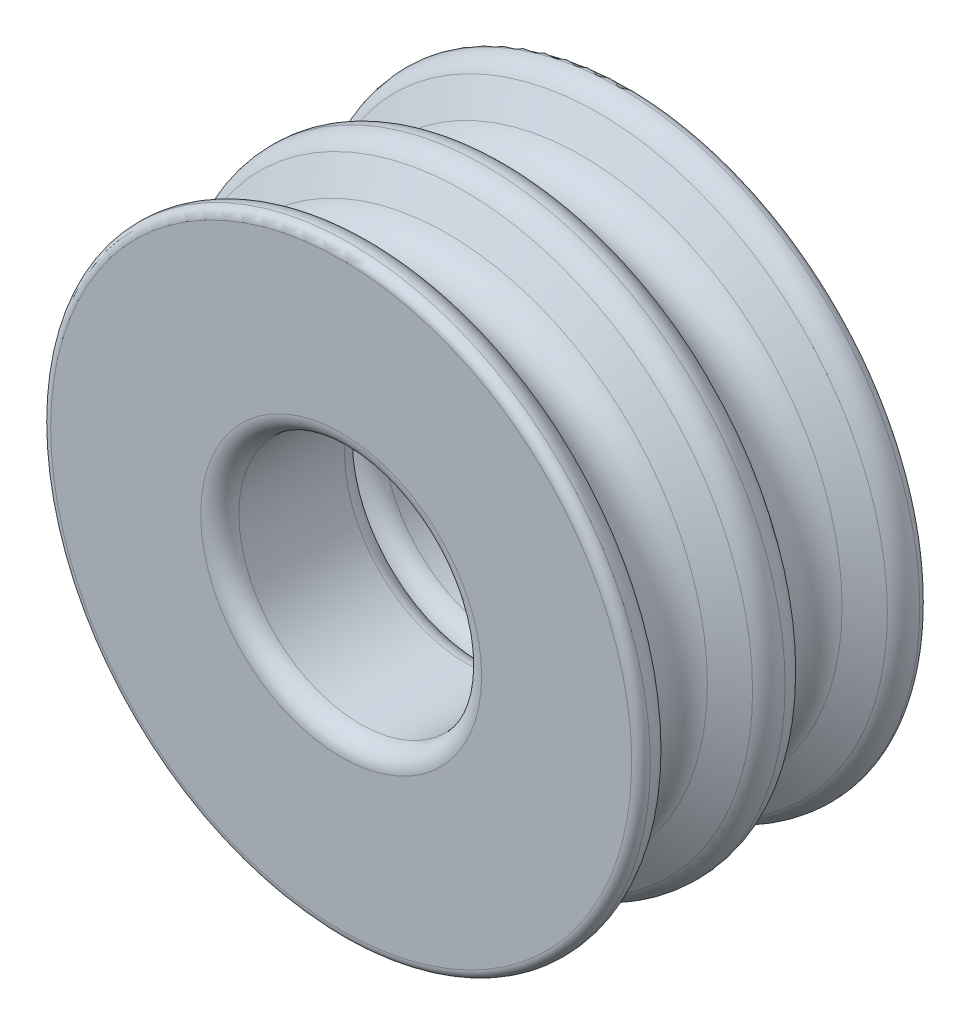
ISO-10303-21;
HEADER;
FILE_DESCRIPTION(('STEP AP214'),'2;1');
FILE_NAME('part.step','',(''),(''),'','','');
FILE_SCHEMA(('AUTOMOTIVE_DESIGN { 1 0 10303 214 1 1 1 1 }'));
ENDSEC;
DATA;
#1=APPLICATION_CONTEXT('core data for automotive mechanical design processes');
#2=APPLICATION_PROTOCOL_DEFINITION('international standard','automotive_design',2000,#1);
#3=PRODUCT_CONTEXT('',#1,'mechanical');
#4=PRODUCT('Part','Part','',(#3));
#5=PRODUCT_RELATED_PRODUCT_CATEGORY('part','',(#4));
#6=PRODUCT_DEFINITION_FORMATION('','',#4);
#7=PRODUCT_DEFINITION_CONTEXT('part definition',#1,'design');
#8=PRODUCT_DEFINITION('design','',#6,#7);
#9=PRODUCT_DEFINITION_SHAPE('','',#8);
#10=(LENGTH_UNIT() NAMED_UNIT(*) SI_UNIT(.MILLI.,.METRE.));
#11=(NAMED_UNIT(*) PLANE_ANGLE_UNIT() SI_UNIT($,.RADIAN.));
#12=(NAMED_UNIT(*) SI_UNIT($,.STERADIAN.) SOLID_ANGLE_UNIT());
#13=UNCERTAINTY_MEASURE_WITH_UNIT(LENGTH_MEASURE(1.E-05),#10,'distance_accuracy_value','');
#14=(GEOMETRIC_REPRESENTATION_CONTEXT(3) GLOBAL_UNCERTAINTY_ASSIGNED_CONTEXT((#13)) GLOBAL_UNIT_ASSIGNED_CONTEXT((#10,
#11,#12)) REPRESENTATION_CONTEXT('',''));
#15=CARTESIAN_POINT('',(0.,0.,0.));
#16=DIRECTION('',(0.,0.,1.));
#17=DIRECTION('',(1.,0.,0.));
#18=AXIS2_PLACEMENT_3D('',#15,#16,#17);
#19=CARTESIAN_POINT('',(0.,0.,3.5));
#20=DIRECTION('',(0.,0.,-1.));
#21=DIRECTION('',(-1.,0.,0.));
#22=AXIS2_PLACEMENT_3D('',#19,#20,#21);
#23=TOROIDAL_SURFACE('',#22,15.2006264756117,0.499999999999999);
#24=CARTESIAN_POINT('',(0.,0.,4.));
#25=DIRECTION('',(0.,0.,-1.));
#26=DIRECTION('',(-1.,0.,0.));
#27=AXIS2_PLACEMENT_3D('',#24,#25,#26);
#28=CIRCLE('',#27,15.2006264756117);
#29=CARTESIAN_POINT('',(-15.2006264756117,0.,4.));
#30=VERTEX_POINT('',#29);
#31=EDGE_CURVE('E69',#30,#30,#28,.T.);
#32=ORIENTED_EDGE('',*,*,#31,.T.);
#33=EDGE_LOOP('',(#32));
#34=FACE_BOUND('',#33,.T.);
#35=CARTESIAN_POINT('',(0.,0.,3.52502165342211));
#36=DIRECTION('',(0.,0.,-1.));
#37=DIRECTION('',(-1.,0.,0.));
#38=AXIS2_PLACEMENT_3D('',#35,#36,#37);
#39=CIRCLE('',#38,15.7);
#40=CARTESIAN_POINT('',(-15.7,0.,3.52502165342211));
#41=VERTEX_POINT('',#40);
#42=EDGE_CURVE('E51',#41,#41,#39,.T.);
#43=ORIENTED_EDGE('',*,*,#42,.F.);
#44=EDGE_LOOP('',(#43));
#45=FACE_BOUND('',#44,.T.);
#46=ADVANCED_FACE('F31',(#34,#45),#23,.T.);
#47=CARTESIAN_POINT('',(0.,0.,3.46496968520905));
#48=DIRECTION('',(0.,0.,-1.));
#49=DIRECTION('',(-1.,0.,0.));
#50=AXIS2_PLACEMENT_3D('',#47,#48,#49);
#51=TOROIDAL_SURFACE('',#50,14.501503541468,1.20000000000002);
#52=ORIENTED_EDGE('',*,*,#42,.T.);
#53=EDGE_LOOP('',(#52));
#54=FACE_BOUND('',#53,.T.);
#55=CARTESIAN_POINT('',(0.,0.,2.4257392006675));
#56=DIRECTION('',(0.,0.,-1.));
#57=DIRECTION('',(-1.,0.,0.));
#58=AXIS2_PLACEMENT_3D('',#55,#56,#57);
#59=CIRCLE('',#58,15.1015035414677);
#60=CARTESIAN_POINT('',(-15.1015035414677,0.,2.4257392006675));
#61=VERTEX_POINT('',#60);
#62=EDGE_CURVE('E54',#61,#61,#59,.T.);
#63=ORIENTED_EDGE('',*,*,#62,.F.);
#64=EDGE_LOOP('',(#63));
#65=FACE_BOUND('',#64,.T.);
#66=ADVANCED_FACE('F154',(#54,#65),#51,.T.);
#67=CARTESIAN_POINT('',(0.,0.,1.55884572681201));
#68=DIRECTION('',(0.,0.,1.));
#69=DIRECTION('',(1.,0.,0.));
#70=AXIS2_PLACEMENT_3D('',#67,#68,#69);
#71=CONICAL_SURFACE('',#70,13.6000000000001,1.04719755119661);
#72=ORIENTED_EDGE('',*,*,#62,.T.);
#73=EDGE_LOOP('',(#72));
#74=FACE_BOUND('',#73,.T.);
#75=CARTESIAN_POINT('',(0.,0.,1.55884572681201));
#76=DIRECTION('',(0.,0.,-1.));
#77=DIRECTION('',(-1.,0.,0.));
#78=AXIS2_PLACEMENT_3D('',#75,#76,#77);
#79=CIRCLE('',#78,13.6000000000001);
#80=CARTESIAN_POINT('',(-13.6000000000001,0.,1.55884572681201));
#81=VERTEX_POINT('',#80);
#82=EDGE_CURVE('E57',#81,#81,#79,.T.);
#83=ORIENTED_EDGE('',*,*,#82,.F.);
#84=EDGE_LOOP('',(#83));
#85=FACE_BOUND('',#84,.T.);
#86=ADVANCED_FACE('F160',(#74,#85),#71,.T.);
#87=CARTESIAN_POINT('',(0.,0.,0.));
#88=DIRECTION('',(0.,0.,-1.));
#89=DIRECTION('',(-1.,0.,0.));
#90=AXIS2_PLACEMENT_3D('',#87,#88,#89);
#91=TOROIDAL_SURFACE('',#90,14.5,1.79999999999998);
#92=ORIENTED_EDGE('',*,*,#82,.T.);
#93=EDGE_LOOP('',(#92));
#94=FACE_BOUND('',#93,.T.);
#95=CARTESIAN_POINT('',(0.,0.,-1.55884572681199));
#96=DIRECTION('',(0.,0.,-1.));
#97=DIRECTION('',(-1.,0.,0.));
#98=AXIS2_PLACEMENT_3D('',#95,#96,#97);
#99=CIRCLE('',#98,13.6);
#100=CARTESIAN_POINT('',(-13.6,0.,-1.55884572681199));
#101=VERTEX_POINT('',#100);
#102=EDGE_CURVE('E60',#101,#101,#99,.T.);
#103=ORIENTED_EDGE('',*,*,#102,.F.);
#104=EDGE_LOOP('',(#103));
#105=FACE_BOUND('',#104,.T.);
#106=ADVANCED_FACE('F150',(#94,#105),#91,.F.);
#107=CARTESIAN_POINT('',(0.,0.,-2.42573920066772));
#108=DIRECTION('',(0.,0.,-1.));
#109=DIRECTION('',(-1.,0.,0.));
#110=AXIS2_PLACEMENT_3D('',#107,#108,#109);
#111=CONICAL_SURFACE('',#110,15.101503541468,1.0471975511966);
#112=ORIENTED_EDGE('',*,*,#102,.T.);
#113=EDGE_LOOP('',(#112));
#114=FACE_BOUND('',#113,.T.);
#115=CARTESIAN_POINT('',(0.,0.,-2.42573920066772));
#116=DIRECTION('',(0.,0.,-1.));
#117=DIRECTION('',(-1.,0.,0.));
#118=AXIS2_PLACEMENT_3D('',#115,#116,#117);
#119=CIRCLE('',#118,15.101503541468);
#120=CARTESIAN_POINT('',(-15.101503541468,0.,-2.42573920066772));
#121=VERTEX_POINT('',#120);
#122=EDGE_CURVE('E63',#121,#121,#119,.T.);
#123=ORIENTED_EDGE('',*,*,#122,.F.);
#124=EDGE_LOOP('',(#123));
#125=FACE_BOUND('',#124,.T.);
#126=ADVANCED_FACE('F141',(#114,#125),#111,.T.);
#127=CARTESIAN_POINT('',(0.,0.,-3.46496968520905));
#128=DIRECTION('',(0.,0.,-1.));
#129=DIRECTION('',(-1.,0.,0.));
#130=AXIS2_PLACEMENT_3D('',#127,#128,#129);
#131=TOROIDAL_SURFACE('',#130,14.501503541468,1.2);
#132=ORIENTED_EDGE('',*,*,#122,.T.);
#133=EDGE_LOOP('',(#132));
#134=FACE_BOUND('',#133,.T.);
#135=CARTESIAN_POINT('',(0.,0.,-3.52502165342211));
#136=DIRECTION('',(0.,0.,-1.));
#137=DIRECTION('',(-1.,0.,0.));
#138=AXIS2_PLACEMENT_3D('',#135,#136,#137);
#139=CIRCLE('',#138,15.7);
#140=CARTESIAN_POINT('',(-15.7,0.,-3.52502165342211));
#141=VERTEX_POINT('',#140);
#142=EDGE_CURVE('E66',#141,#141,#139,.T.);
#143=ORIENTED_EDGE('',*,*,#142,.F.);
#144=EDGE_LOOP('',(#143));
#145=FACE_BOUND('',#144,.T.);
#146=ADVANCED_FACE('F138',(#134,#145),#131,.T.);
#147=CARTESIAN_POINT('',(0.,0.,3.99999999999767));
#148=DIRECTION('',(0.,0.,1.));
#149=DIRECTION('',(1.,0.,0.));
#150=AXIS2_PLACEMENT_3D('',#147,#148,#149);
#151=PLANE('',#150);
#152=CARTESIAN_POINT('',(0.,0.,3.99999999999767));
#153=DIRECTION('',(0.,0.,1.));
#154=DIRECTION('',(1.,0.,0.));
#155=AXIS2_PLACEMENT_3D('',#152,#153,#154);
#156=CIRCLE('',#155,7.35);
#157=CARTESIAN_POINT('',(7.35,0.,3.99999999999767));
#158=VERTEX_POINT('',#157);
#159=EDGE_CURVE('E10',#158,#158,#156,.F.);
#160=ORIENTED_EDGE('',*,*,#159,.T.);
#161=EDGE_LOOP('',(#160));
#162=FACE_BOUND('',#161,.T.);
#163=ORIENTED_EDGE('',*,*,#31,.F.);
#164=EDGE_LOOP('',(#163));
#165=FACE_BOUND('',#164,.T.);
#166=ADVANCED_FACE('F140',(#162,#165),#151,.T.);
#167=CARTESIAN_POINT('',(0.,0.,-3.52502165342211));
#168=DIRECTION('',(0.,0.,1.));
#169=DIRECTION('',(1.,0.,0.));
#170=AXIS2_PLACEMENT_3D('',#167,#168,#169);
#171=CYLINDRICAL_SURFACE('',#170,6.35);
#172=CARTESIAN_POINT('',(0.,0.,-2.52502165342211));
#173=DIRECTION('',(0.,0.,-1.));
#174=DIRECTION('',(-1.,0.,0.));
#175=AXIS2_PLACEMENT_3D('',#172,#173,#174);
#176=CIRCLE('',#175,6.35);
#177=CARTESIAN_POINT('',(-6.35,0.,-2.52502165342211));
#178=VERTEX_POINT('',#177);
#179=EDGE_CURVE('E38',#178,#178,#176,.T.);
#180=ORIENTED_EDGE('',*,*,#179,.T.);
#181=EDGE_LOOP('',(#180));
#182=FACE_BOUND('',#181,.T.);
#183=CARTESIAN_POINT('',(0.,0.,2.99999999999767));
#184=DIRECTION('',(0.,0.,1.));
#185=DIRECTION('',(1.,0.,0.));
#186=AXIS2_PLACEMENT_3D('',#183,#184,#185);
#187=CIRCLE('',#186,6.35);
#188=CARTESIAN_POINT('',(6.35,0.,2.99999999999767));
#189=VERTEX_POINT('',#188);
#190=EDGE_CURVE('E42',#189,#189,#187,.T.);
#191=ORIENTED_EDGE('',*,*,#190,.T.);
#192=EDGE_LOOP('',(#191));
#193=FACE_BOUND('',#192,.T.);
#194=ADVANCED_FACE('F148',(#182,#193),#171,.F.);
#195=CARTESIAN_POINT('',(0.,0.,-2.52502165342211));
#196=DIRECTION('',(0.,0.,-1.));
#197=DIRECTION('',(-1.,0.,0.));
#198=AXIS2_PLACEMENT_3D('',#195,#196,#197);
#199=TOROIDAL_SURFACE('',#198,7.35,1.);
#200=ORIENTED_EDGE('',*,*,#179,.F.);
#201=EDGE_LOOP('',(#200));
#202=FACE_BOUND('',#201,.T.);
#203=CARTESIAN_POINT('',(0.,0.,-3.52502165342211));
#204=DIRECTION('',(0.,0.,-1.));
#205=DIRECTION('',(-1.,0.,0.));
#206=AXIS2_PLACEMENT_3D('',#203,#204,#205);
#207=CIRCLE('',#206,7.35);
#208=CARTESIAN_POINT('',(-7.35,0.,-3.52502165342211));
#209=VERTEX_POINT('',#208);
#210=EDGE_CURVE('E46',#209,#209,#207,.F.);
#211=ORIENTED_EDGE('',*,*,#210,.F.);
#212=EDGE_LOOP('',(#211));
#213=FACE_BOUND('',#212,.T.);
#214=ADVANCED_FACE('F165',(#202,#213),#199,.T.);
#215=CARTESIAN_POINT('',(0.,0.,2.99999999999767));
#216=DIRECTION('',(0.,0.,1.));
#217=DIRECTION('',(1.,0.,0.));
#218=AXIS2_PLACEMENT_3D('',#215,#216,#217);
#219=TOROIDAL_SURFACE('',#218,7.35,1.);
#220=ORIENTED_EDGE('',*,*,#159,.F.);
#221=EDGE_LOOP('',(#220));
#222=FACE_BOUND('',#221,.T.);
#223=ORIENTED_EDGE('',*,*,#190,.F.);
#224=EDGE_LOOP('',(#223));
#225=FACE_BOUND('',#224,.T.);
#226=ADVANCED_FACE('F33',(#222,#225),#219,.T.);
#227=CARTESIAN_POINT('',(0.,0.,-10.5500433068442));
#228=DIRECTION('',(0.,0.,1.));
#229=DIRECTION('',(-1.,0.,0.));
#230=AXIS2_PLACEMENT_3D('',#227,#228,#229);
#231=TOROIDAL_SURFACE('',#230,15.2006264756117,0.499999999999999);
#232=CARTESIAN_POINT('',(0.,0.,-11.0500433068442));
#233=DIRECTION('',(0.,0.,-1.));
#234=DIRECTION('',(-1.,0.,0.));
#235=AXIS2_PLACEMENT_3D('',#232,#233,#234);
#236=CIRCLE('',#235,15.2006264756117);
#237=CARTESIAN_POINT('',(-15.2006264756117,0.,-11.0500433068442));
#238=VERTEX_POINT('',#237);
#239=EDGE_CURVE('E96',#238,#238,#236,.T.);
#240=ORIENTED_EDGE('',*,*,#239,.F.);
#241=EDGE_LOOP('',(#240));
#242=FACE_BOUND('',#241,.T.);
#243=CARTESIAN_POINT('',(0.,0.,-10.5750649602663));
#244=DIRECTION('',(0.,0.,-1.));
#245=DIRECTION('',(-1.,0.,0.));
#246=AXIS2_PLACEMENT_3D('',#243,#244,#245);
#247=CIRCLE('',#246,15.7);
#248=CARTESIAN_POINT('',(-15.7,0.,-10.5750649602663));
#249=VERTEX_POINT('',#248);
#250=EDGE_CURVE('E81',#249,#249,#247,.T.);
#251=ORIENTED_EDGE('',*,*,#250,.T.);
#252=EDGE_LOOP('',(#251));
#253=FACE_BOUND('',#252,.T.);
#254=ADVANCED_FACE('F102',(#242,#253),#231,.T.);
#255=CARTESIAN_POINT('',(0.,0.,-10.5150129920533));
#256=DIRECTION('',(0.,0.,1.));
#257=DIRECTION('',(-1.,0.,0.));
#258=AXIS2_PLACEMENT_3D('',#255,#256,#257);
#259=TOROIDAL_SURFACE('',#258,14.501503541468,1.20000000000002);
#260=ORIENTED_EDGE('',*,*,#250,.F.);
#261=EDGE_LOOP('',(#260));
#262=FACE_BOUND('',#261,.T.);
#263=CARTESIAN_POINT('',(0.,0.,-9.47578250751172));
#264=DIRECTION('',(0.,0.,-1.));
#265=DIRECTION('',(-1.,0.,0.));
#266=AXIS2_PLACEMENT_3D('',#263,#264,#265);
#267=CIRCLE('',#266,15.1015035414677);
#268=CARTESIAN_POINT('',(-15.1015035414677,0.,-9.47578250751172));
#269=VERTEX_POINT('',#268);
#270=EDGE_CURVE('E84',#269,#269,#267,.T.);
#271=ORIENTED_EDGE('',*,*,#270,.T.);
#272=EDGE_LOOP('',(#271));
#273=FACE_BOUND('',#272,.T.);
#274=ADVANCED_FACE('F105',(#262,#273),#259,.T.);
#275=CARTESIAN_POINT('',(0.,0.,-8.60888903365623));
#276=DIRECTION('',(0.,0.,-1.));
#277=DIRECTION('',(1.,0.,0.));
#278=AXIS2_PLACEMENT_3D('',#275,#276,#277);
#279=CONICAL_SURFACE('',#278,13.6000000000001,1.04719755119661);
#280=ORIENTED_EDGE('',*,*,#270,.F.);
#281=EDGE_LOOP('',(#280));
#282=FACE_BOUND('',#281,.T.);
#283=CARTESIAN_POINT('',(0.,0.,-8.60888903365623));
#284=DIRECTION('',(0.,0.,-1.));
#285=DIRECTION('',(-1.,0.,0.));
#286=AXIS2_PLACEMENT_3D('',#283,#284,#285);
#287=CIRCLE('',#286,13.6000000000001);
#288=CARTESIAN_POINT('',(-13.6000000000001,0.,-8.60888903365623));
#289=VERTEX_POINT('',#288);
#290=EDGE_CURVE('E87',#289,#289,#287,.T.);
#291=ORIENTED_EDGE('',*,*,#290,.T.);
#292=EDGE_LOOP('',(#291));
#293=FACE_BOUND('',#292,.T.);
#294=ADVANCED_FACE('F111',(#282,#293),#279,.T.);
#295=CARTESIAN_POINT('',(0.,0.,-7.05004330684422));
#296=DIRECTION('',(0.,0.,1.));
#297=DIRECTION('',(-1.,0.,0.));
#298=AXIS2_PLACEMENT_3D('',#295,#296,#297);
#299=TOROIDAL_SURFACE('',#298,14.5,1.79999999999998);
#300=ORIENTED_EDGE('',*,*,#290,.F.);
#301=EDGE_LOOP('',(#300));
#302=FACE_BOUND('',#301,.T.);
#303=CARTESIAN_POINT('',(0.,0.,-5.49119758003223));
#304=DIRECTION('',(0.,0.,-1.));
#305=DIRECTION('',(-1.,0.,0.));
#306=AXIS2_PLACEMENT_3D('',#303,#304,#305);
#307=CIRCLE('',#306,13.6);
#308=CARTESIAN_POINT('',(-13.6,0.,-5.49119758003223));
#309=VERTEX_POINT('',#308);
#310=EDGE_CURVE('E90',#309,#309,#307,.T.);
#311=ORIENTED_EDGE('',*,*,#310,.T.);
#312=EDGE_LOOP('',(#311));
#313=FACE_BOUND('',#312,.T.);
#314=ADVANCED_FACE('F117',(#302,#313),#299,.F.);
#315=CARTESIAN_POINT('',(0.,0.,-4.6243041061765));
#316=DIRECTION('',(0.,0.,1.));
#317=DIRECTION('',(-1.,0.,0.));
#318=AXIS2_PLACEMENT_3D('',#315,#316,#317);
#319=CONICAL_SURFACE('',#318,15.101503541468,1.0471975511966);
#320=ORIENTED_EDGE('',*,*,#310,.F.);
#321=EDGE_LOOP('',(#320));
#322=FACE_BOUND('',#321,.T.);
#323=CARTESIAN_POINT('',(0.,0.,-4.6243041061765));
#324=DIRECTION('',(0.,0.,-1.));
#325=DIRECTION('',(-1.,0.,0.));
#326=AXIS2_PLACEMENT_3D('',#323,#324,#325);
#327=CIRCLE('',#326,15.101503541468);
#328=CARTESIAN_POINT('',(-15.101503541468,0.,-4.6243041061765));
#329=VERTEX_POINT('',#328);
#330=EDGE_CURVE('E93',#329,#329,#327,.T.);
#331=ORIENTED_EDGE('',*,*,#330,.T.);
#332=EDGE_LOOP('',(#331));
#333=FACE_BOUND('',#332,.T.);
#334=ADVANCED_FACE('F123',(#322,#333),#319,.T.);
#335=CARTESIAN_POINT('',(0.,0.,-3.58507362163517));
#336=DIRECTION('',(0.,0.,1.));
#337=DIRECTION('',(-1.,0.,0.));
#338=AXIS2_PLACEMENT_3D('',#335,#336,#337);
#339=TOROIDAL_SURFACE('',#338,14.501503541468,1.2);
#340=ORIENTED_EDGE('',*,*,#330,.F.);
#341=EDGE_LOOP('',(#340));
#342=FACE_BOUND('',#341,.T.);
#343=ORIENTED_EDGE('',*,*,#142,.T.);
#344=EDGE_LOOP('',(#343));
#345=FACE_BOUND('',#344,.T.);
#346=ADVANCED_FACE('F129',(#342,#345),#339,.T.);
#347=CARTESIAN_POINT('',(0.,0.,-11.0500433068419));
#348=DIRECTION('',(0.,0.,-1.));
#349=DIRECTION('',(1.,0.,0.));
#350=AXIS2_PLACEMENT_3D('',#347,#348,#349);
#351=PLANE('',#350);
#352=CARTESIAN_POINT('',(0.,0.,-11.0500433068419));
#353=DIRECTION('',(0.,0.,1.));
#354=DIRECTION('',(1.,0.,0.));
#355=AXIS2_PLACEMENT_3D('',#352,#353,#354);
#356=CIRCLE('',#355,7.35);
#357=CARTESIAN_POINT('',(7.35,0.,-11.0500433068419));
#358=VERTEX_POINT('',#357);
#359=EDGE_CURVE('E72',#358,#358,#356,.F.);
#360=ORIENTED_EDGE('',*,*,#359,.F.);
#361=EDGE_LOOP('',(#360));
#362=FACE_BOUND('',#361,.T.);
#363=ORIENTED_EDGE('',*,*,#239,.T.);
#364=EDGE_LOOP('',(#363));
#365=FACE_BOUND('',#364,.T.);
#366=ADVANCED_FACE('F100',(#362,#365),#351,.T.);
#367=CARTESIAN_POINT('',(0.,0.,-3.52502165342211));
#368=DIRECTION('',(0.,0.,-1.));
#369=DIRECTION('',(1.,0.,0.));
#370=AXIS2_PLACEMENT_3D('',#367,#368,#369);
#371=CYLINDRICAL_SURFACE('',#370,6.35);
#372=CARTESIAN_POINT('',(0.,0.,-4.52502165342211));
#373=DIRECTION('',(0.,0.,-1.));
#374=DIRECTION('',(-1.,0.,0.));
#375=AXIS2_PLACEMENT_3D('',#372,#373,#374);
#376=CIRCLE('',#375,6.35);
#377=CARTESIAN_POINT('',(-6.35,0.,-4.52502165342211));
#378=VERTEX_POINT('',#377);
#379=EDGE_CURVE('E75',#378,#378,#376,.T.);
#380=ORIENTED_EDGE('',*,*,#379,.F.);
#381=EDGE_LOOP('',(#380));
#382=FACE_BOUND('',#381,.T.);
#383=CARTESIAN_POINT('',(0.,0.,-10.0500433068419));
#384=DIRECTION('',(0.,0.,1.));
#385=DIRECTION('',(1.,0.,0.));
#386=AXIS2_PLACEMENT_3D('',#383,#384,#385);
#387=CIRCLE('',#386,6.35);
#388=CARTESIAN_POINT('',(6.35,0.,-10.0500433068419));
#389=VERTEX_POINT('',#388);
#390=EDGE_CURVE('E78',#389,#389,#387,.T.);
#391=ORIENTED_EDGE('',*,*,#390,.F.);
#392=EDGE_LOOP('',(#391));
#393=FACE_BOUND('',#392,.T.);
#394=ADVANCED_FACE('F180',(#382,#393),#371,.F.);
#395=CARTESIAN_POINT('',(0.,0.,-4.52502165342211));
#396=DIRECTION('',(0.,0.,1.));
#397=DIRECTION('',(-1.,0.,0.));
#398=AXIS2_PLACEMENT_3D('',#395,#396,#397);
#399=TOROIDAL_SURFACE('',#398,7.35,1.);
#400=ORIENTED_EDGE('',*,*,#379,.T.);
#401=EDGE_LOOP('',(#400));
#402=FACE_BOUND('',#401,.T.);
#403=ORIENTED_EDGE('',*,*,#210,.T.);
#404=EDGE_LOOP('',(#403));
#405=FACE_BOUND('',#404,.T.);
#406=ADVANCED_FACE('F177',(#402,#405),#399,.T.);
#407=CARTESIAN_POINT('',(0.,0.,-10.0500433068419));
#408=DIRECTION('',(0.,0.,-1.));
#409=DIRECTION('',(1.,0.,0.));
#410=AXIS2_PLACEMENT_3D('',#407,#408,#409);
#411=TOROIDAL_SURFACE('',#410,7.35,1.);
#412=ORIENTED_EDGE('',*,*,#359,.T.);
#413=EDGE_LOOP('',(#412));
#414=FACE_BOUND('',#413,.T.);
#415=ORIENTED_EDGE('',*,*,#390,.T.);
#416=EDGE_LOOP('',(#415));
#417=FACE_BOUND('',#416,.T.);
#418=ADVANCED_FACE('F179',(#414,#417),#411,.T.);
#419=CLOSED_SHELL('',(#46,#66,#86,#106,#126,#146,#166,#194,#214,#226,#254,#274,#294,#314,#334,
#346,#366,#394,#406,#418));
#420=MANIFOLD_SOLID_BREP('B2',#419);
#421=ADVANCED_BREP_SHAPE_REPRESENTATION('',(#18,#420),#14);
#422=SHAPE_DEFINITION_REPRESENTATION(#9,#421);
ENDSEC;
END-ISO-10303-21;
